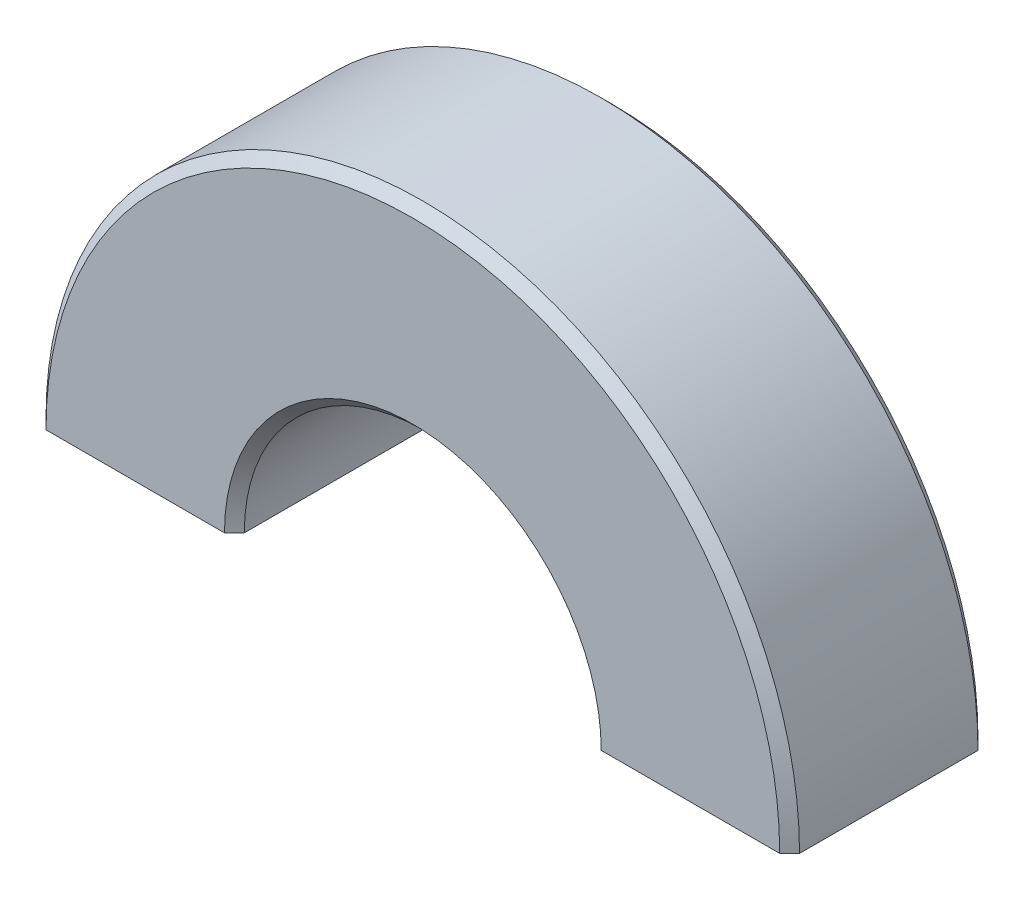
ISO-10303-21;
HEADER;
FILE_DESCRIPTION(('STEP AP214'),'2;1');
FILE_NAME('part.step','',(''),(''),'','','');
FILE_SCHEMA(('AUTOMOTIVE_DESIGN { 1 0 10303 214 1 1 1 1 }'));
ENDSEC;
DATA;
#1=APPLICATION_CONTEXT('core data for automotive mechanical design processes');
#2=APPLICATION_PROTOCOL_DEFINITION('international standard','automotive_design',2000,#1);
#3=PRODUCT_CONTEXT('',#1,'mechanical');
#4=PRODUCT('Part','Part','',(#3));
#5=PRODUCT_RELATED_PRODUCT_CATEGORY('part','',(#4));
#6=PRODUCT_DEFINITION_FORMATION('','',#4);
#7=PRODUCT_DEFINITION_CONTEXT('part definition',#1,'design');
#8=PRODUCT_DEFINITION('design','',#6,#7);
#9=PRODUCT_DEFINITION_SHAPE('','',#8);
#10=(LENGTH_UNIT() NAMED_UNIT(*) SI_UNIT(.MILLI.,.METRE.));
#11=(NAMED_UNIT(*) PLANE_ANGLE_UNIT() SI_UNIT($,.RADIAN.));
#12=(NAMED_UNIT(*) SI_UNIT($,.STERADIAN.) SOLID_ANGLE_UNIT());
#13=UNCERTAINTY_MEASURE_WITH_UNIT(LENGTH_MEASURE(1.E-05),#10,'distance_accuracy_value','');
#14=(GEOMETRIC_REPRESENTATION_CONTEXT(3) GLOBAL_UNCERTAINTY_ASSIGNED_CONTEXT((#13)) GLOBAL_UNIT_ASSIGNED_CONTEXT((#10,
#11,#12)) REPRESENTATION_CONTEXT('',''));
#15=CARTESIAN_POINT('',(0.,0.,0.));
#16=DIRECTION('',(0.,0.,1.));
#17=DIRECTION('',(1.,0.,0.));
#18=AXIS2_PLACEMENT_3D('',#15,#16,#17);
#19=CARTESIAN_POINT('',(0.,0.,10.));
#20=DIRECTION('',(0.,0.,-1.));
#21=DIRECTION('',(-1.,0.,0.));
#22=AXIS2_PLACEMENT_3D('',#19,#20,#21);
#23=CYLINDRICAL_SURFACE('',#22,9.);
#24=DIRECTION('',(0.,0.,-1.));
#25=VECTOR('',#24,1.);
#26=CARTESIAN_POINT('',(-9.,0.,10.));
#27=LINE('',#26,#25);
#28=CARTESIAN_POINT('',(-9.,0.,9.49999999999999));
#29=VERTEX_POINT('',#28);
#30=CARTESIAN_POINT('',(-9.,0.,0.500000000000011));
#31=VERTEX_POINT('',#30);
#32=EDGE_CURVE('E127',#29,#31,#27,.T.);
#33=ORIENTED_EDGE('',*,*,#32,.T.);
#34=CARTESIAN_POINT('',(0.,0.,0.500000000000011));
#35=DIRECTION('',(0.,0.,1.));
#36=DIRECTION('',(1.,0.,0.));
#37=AXIS2_PLACEMENT_3D('',#34,#35,#36);
#38=CIRCLE('',#37,9.);
#39=CARTESIAN_POINT('',(9.,0.,0.500000000000011));
#40=VERTEX_POINT('',#39);
#41=EDGE_CURVE('E153',#31,#40,#38,.F.);
#42=ORIENTED_EDGE('',*,*,#41,.T.);
#43=DIRECTION('',(0.,0.,-1.));
#44=VECTOR('',#43,1.);
#45=CARTESIAN_POINT('',(9.,0.,10.));
#46=LINE('',#45,#44);
#47=CARTESIAN_POINT('',(9.,0.,9.49999999999999));
#48=VERTEX_POINT('',#47);
#49=EDGE_CURVE('E131',#48,#40,#46,.T.);
#50=ORIENTED_EDGE('',*,*,#49,.F.);
#51=CARTESIAN_POINT('',(0.,0.,9.49999999999999));
#52=DIRECTION('',(0.,0.,1.));
#53=DIRECTION('',(1.,0.,0.));
#54=AXIS2_PLACEMENT_3D('',#51,#52,#53);
#55=CIRCLE('',#54,9.);
#56=EDGE_CURVE('E151',#48,#29,#55,.T.);
#57=ORIENTED_EDGE('',*,*,#56,.T.);
#58=EDGE_LOOP('',(#33,#42,#50,#57));
#59=FACE_BOUND('',#58,.T.);
#60=ADVANCED_FACE('F38',(#59),#23,.F.);
#61=CARTESIAN_POINT('',(9.,0.,10.));
#62=DIRECTION('',(0.,1.,0.));
#63=DIRECTION('',(-1.,0.,0.));
#64=AXIS2_PLACEMENT_3D('',#61,#62,#63);
#65=PLANE('',#64);
#66=DIRECTION('',(1.,0.,0.));
#67=VECTOR('',#66,1.);
#68=CARTESIAN_POINT('',(9.,0.,0.));
#69=LINE('',#68,#67);
#70=CARTESIAN_POINT('',(9.50000000000002,0.,0.));
#71=VERTEX_POINT('',#70);
#72=CARTESIAN_POINT('',(18.5,0.,0.));
#73=VERTEX_POINT('',#72);
#74=EDGE_CURVE('E163',#71,#73,#69,.T.);
#75=ORIENTED_EDGE('',*,*,#74,.T.);
#76=DIRECTION('',(-0.707106781186545,0.,-0.70710678118655));
#77=VECTOR('',#76,1.);
#78=CARTESIAN_POINT('',(0.,0.,-18.5000000000001));
#79=LINE('',#78,#77);
#80=CARTESIAN_POINT('',(19.,0.,0.500000000000011));
#81=VERTEX_POINT('',#80);
#82=EDGE_CURVE('E149',#73,#81,#79,.F.);
#83=ORIENTED_EDGE('',*,*,#82,.T.);
#84=DIRECTION('',(0.,0.,-1.));
#85=VECTOR('',#84,1.);
#86=CARTESIAN_POINT('',(19.,0.,10.));
#87=LINE('',#86,#85);
#88=CARTESIAN_POINT('',(19.,0.,9.50000000000001));
#89=VERTEX_POINT('',#88);
#90=EDGE_CURVE('E126',#89,#81,#87,.T.);
#91=ORIENTED_EDGE('',*,*,#90,.F.);
#92=DIRECTION('',(0.707106781186545,0.,-0.70710678118655));
#93=VECTOR('',#92,1.);
#94=CARTESIAN_POINT('',(0.,0.,28.5000000000001));
#95=LINE('',#94,#93);
#96=CARTESIAN_POINT('',(18.5,0.,10.));
#97=VERTEX_POINT('',#96);
#98=EDGE_CURVE('E130',#89,#97,#95,.F.);
#99=ORIENTED_EDGE('',*,*,#98,.T.);
#100=DIRECTION('',(1.,0.,0.));
#101=VECTOR('',#100,1.);
#102=CARTESIAN_POINT('',(9.,0.,10.));
#103=LINE('',#102,#101);
#104=CARTESIAN_POINT('',(9.50000000000001,0.,10.));
#105=VERTEX_POINT('',#104);
#106=EDGE_CURVE('E158',#105,#97,#103,.T.);
#107=ORIENTED_EDGE('',*,*,#106,.F.);
#108=DIRECTION('',(-0.707106781186547,0.,-0.707106781186548));
#109=VECTOR('',#108,1.);
#110=CARTESIAN_POINT('',(0.,0.,0.499999999999992));
#111=LINE('',#110,#109);
#112=EDGE_CURVE('E62',#105,#48,#111,.T.);
#113=ORIENTED_EDGE('',*,*,#112,.T.);
#114=ORIENTED_EDGE('',*,*,#49,.T.);
#115=DIRECTION('',(0.707106781186551,0.,-0.707106781186544));
#116=VECTOR('',#115,1.);
#117=CARTESIAN_POINT('',(0.,0.,9.49999999999992));
#118=LINE('',#117,#116);
#119=EDGE_CURVE('E54',#40,#71,#118,.T.);
#120=ORIENTED_EDGE('',*,*,#119,.T.);
#121=EDGE_LOOP('',(#75,#83,#91,#99,#107,#113,#114,#120));
#122=FACE_BOUND('',#121,.T.);
#123=ADVANCED_FACE('F193',(#122),#65,.F.);
#124=CARTESIAN_POINT('',(0.,0.,10.));
#125=DIRECTION('',(0.,0.,-1.));
#126=DIRECTION('',(-1.,0.,0.));
#127=AXIS2_PLACEMENT_3D('',#124,#125,#126);
#128=CYLINDRICAL_SURFACE('',#127,19.);
#129=ORIENTED_EDGE('',*,*,#90,.T.);
#130=CARTESIAN_POINT('',(0.,0.,0.500000000000011));
#131=DIRECTION('',(0.,0.,1.));
#132=DIRECTION('',(1.,0.,0.));
#133=AXIS2_PLACEMENT_3D('',#130,#131,#132);
#134=CIRCLE('',#133,19.);
#135=CARTESIAN_POINT('',(-19.,0.,0.500000000000011));
#136=VERTEX_POINT('',#135);
#137=EDGE_CURVE('E117',#81,#136,#134,.T.);
#138=ORIENTED_EDGE('',*,*,#137,.T.);
#139=DIRECTION('',(0.,0.,-1.));
#140=VECTOR('',#139,1.);
#141=CARTESIAN_POINT('',(-19.,0.,10.));
#142=LINE('',#141,#140);
#143=CARTESIAN_POINT('',(-19.,0.,9.50000000000001));
#144=VERTEX_POINT('',#143);
#145=EDGE_CURVE('E109',#144,#136,#142,.T.);
#146=ORIENTED_EDGE('',*,*,#145,.F.);
#147=CARTESIAN_POINT('',(0.,0.,9.50000000000001));
#148=DIRECTION('',(0.,0.,1.));
#149=DIRECTION('',(1.,0.,0.));
#150=AXIS2_PLACEMENT_3D('',#147,#148,#149);
#151=CIRCLE('',#150,19.);
#152=EDGE_CURVE('E123',#144,#89,#151,.F.);
#153=ORIENTED_EDGE('',*,*,#152,.T.);
#154=EDGE_LOOP('',(#129,#138,#146,#153));
#155=FACE_BOUND('',#154,.T.);
#156=ADVANCED_FACE('F122',(#155),#128,.T.);
#157=CARTESIAN_POINT('',(-9.,0.,10.));
#158=DIRECTION('',(0.,1.,0.));
#159=DIRECTION('',(-1.,0.,0.));
#160=AXIS2_PLACEMENT_3D('',#157,#158,#159);
#161=PLANE('',#160);
#162=ORIENTED_EDGE('',*,*,#145,.T.);
#163=DIRECTION('',(-0.707106781186545,0.,0.70710678118655));
#164=VECTOR('',#163,1.);
#165=CARTESIAN_POINT('',(0.,0.,-18.5000000000001));
#166=LINE('',#165,#164);
#167=CARTESIAN_POINT('',(-18.5,0.,0.));
#168=VERTEX_POINT('',#167);
#169=EDGE_CURVE('E140',#136,#168,#166,.F.);
#170=ORIENTED_EDGE('',*,*,#169,.T.);
#171=DIRECTION('',(1.,0.,0.));
#172=VECTOR('',#171,1.);
#173=CARTESIAN_POINT('',(-9.,0.,0.));
#174=LINE('',#173,#172);
#175=CARTESIAN_POINT('',(-9.50000000000002,0.,0.));
#176=VERTEX_POINT('',#175);
#177=EDGE_CURVE('E159',#168,#176,#174,.T.);
#178=ORIENTED_EDGE('',*,*,#177,.T.);
#179=DIRECTION('',(0.707106781186551,0.,0.707106781186544));
#180=VECTOR('',#179,1.);
#181=CARTESIAN_POINT('',(0.,0.,9.49999999999992));
#182=LINE('',#181,#180);
#183=EDGE_CURVE('E138',#176,#31,#182,.T.);
#184=ORIENTED_EDGE('',*,*,#183,.T.);
#185=ORIENTED_EDGE('',*,*,#32,.F.);
#186=DIRECTION('',(-0.707106781186547,0.,0.707106781186548));
#187=VECTOR('',#186,1.);
#188=CARTESIAN_POINT('',(0.,0.,0.499999999999992));
#189=LINE('',#188,#187);
#190=CARTESIAN_POINT('',(-9.50000000000001,0.,10.));
#191=VERTEX_POINT('',#190);
#192=EDGE_CURVE('E116',#29,#191,#189,.T.);
#193=ORIENTED_EDGE('',*,*,#192,.T.);
#194=DIRECTION('',(1.,0.,0.));
#195=VECTOR('',#194,1.);
#196=CARTESIAN_POINT('',(-9.,0.,10.));
#197=LINE('',#196,#195);
#198=CARTESIAN_POINT('',(-18.5,0.,10.));
#199=VERTEX_POINT('',#198);
#200=EDGE_CURVE('E111',#199,#191,#197,.T.);
#201=ORIENTED_EDGE('',*,*,#200,.F.);
#202=DIRECTION('',(0.707106781186545,0.,0.70710678118655));
#203=VECTOR('',#202,1.);
#204=CARTESIAN_POINT('',(0.,0.,28.5000000000001));
#205=LINE('',#204,#203);
#206=EDGE_CURVE('E106',#199,#144,#205,.F.);
#207=ORIENTED_EDGE('',*,*,#206,.T.);
#208=EDGE_LOOP('',(#162,#170,#178,#184,#185,#193,#201,#207));
#209=FACE_BOUND('',#208,.T.);
#210=ADVANCED_FACE('F108',(#209),#161,.F.);
#211=CARTESIAN_POINT('',(0.,0.,10.));
#212=DIRECTION('',(0.,0.,1.));
#213=DIRECTION('',(1.,0.,0.));
#214=AXIS2_PLACEMENT_3D('',#211,#212,#213);
#215=PLANE('',#214);
#216=ORIENTED_EDGE('',*,*,#200,.T.);
#217=CARTESIAN_POINT('',(0.,0.,10.));
#218=DIRECTION('',(0.,0.,1.));
#219=DIRECTION('',(1.,0.,0.));
#220=AXIS2_PLACEMENT_3D('',#217,#218,#219);
#221=CIRCLE('',#220,9.50000000000001);
#222=EDGE_CURVE('E11',#191,#105,#221,.F.);
#223=ORIENTED_EDGE('',*,*,#222,.T.);
#224=ORIENTED_EDGE('',*,*,#106,.T.);
#225=CARTESIAN_POINT('',(0.,0.,10.));
#226=DIRECTION('',(0.,0.,1.));
#227=DIRECTION('',(1.,0.,0.));
#228=AXIS2_PLACEMENT_3D('',#225,#226,#227);
#229=CIRCLE('',#228,18.5);
#230=EDGE_CURVE('E47',#97,#199,#229,.T.);
#231=ORIENTED_EDGE('',*,*,#230,.T.);
#232=EDGE_LOOP('',(#216,#223,#224,#231));
#233=FACE_BOUND('',#232,.T.);
#234=ADVANCED_FACE('F156',(#233),#215,.T.);
#235=CARTESIAN_POINT('',(0.,0.,0.));
#236=DIRECTION('',(0.,0.,1.));
#237=DIRECTION('',(1.,0.,0.));
#238=AXIS2_PLACEMENT_3D('',#235,#236,#237);
#239=PLANE('',#238);
#240=ORIENTED_EDGE('',*,*,#177,.F.);
#241=CARTESIAN_POINT('',(0.,0.,0.));
#242=DIRECTION('',(0.,0.,1.));
#243=DIRECTION('',(1.,0.,0.));
#244=AXIS2_PLACEMENT_3D('',#241,#242,#243);
#245=CIRCLE('',#244,18.5);
#246=EDGE_CURVE('E144',#168,#73,#245,.F.);
#247=ORIENTED_EDGE('',*,*,#246,.T.);
#248=ORIENTED_EDGE('',*,*,#74,.F.);
#249=CARTESIAN_POINT('',(0.,0.,0.));
#250=DIRECTION('',(0.,0.,1.));
#251=DIRECTION('',(1.,0.,0.));
#252=AXIS2_PLACEMENT_3D('',#249,#250,#251);
#253=CIRCLE('',#252,9.50000000000002);
#254=EDGE_CURVE('E142',#71,#176,#253,.T.);
#255=ORIENTED_EDGE('',*,*,#254,.T.);
#256=EDGE_LOOP('',(#240,#247,#248,#255));
#257=FACE_BOUND('',#256,.T.);
#258=ADVANCED_FACE('F176',(#257),#239,.F.);
#259=CARTESIAN_POINT('',(0.,0.,0.500000000000011));
#260=DIRECTION('',(0.,0.,1.));
#261=DIRECTION('',(1.,0.,0.));
#262=AXIS2_PLACEMENT_3D('',#259,#260,#261);
#263=CONICAL_SURFACE('',#262,19.,0.785398163397445);
#264=ORIENTED_EDGE('',*,*,#82,.F.);
#265=ORIENTED_EDGE('',*,*,#246,.F.);
#266=ORIENTED_EDGE('',*,*,#169,.F.);
#267=ORIENTED_EDGE('',*,*,#137,.F.);
#268=EDGE_LOOP('',(#264,#265,#266,#267));
#269=FACE_BOUND('',#268,.T.);
#270=ADVANCED_FACE('F171',(#269),#263,.T.);
#271=CARTESIAN_POINT('',(0.,0.,0.500000000000011));
#272=DIRECTION('',(0.,0.,-1.));
#273=DIRECTION('',(-1.,0.,0.));
#274=AXIS2_PLACEMENT_3D('',#271,#272,#273);
#275=CONICAL_SURFACE('',#274,9.,0.785398163397453);
#276=ORIENTED_EDGE('',*,*,#183,.F.);
#277=ORIENTED_EDGE('',*,*,#254,.F.);
#278=ORIENTED_EDGE('',*,*,#119,.F.);
#279=ORIENTED_EDGE('',*,*,#41,.F.);
#280=EDGE_LOOP('',(#276,#277,#278,#279));
#281=FACE_BOUND('',#280,.T.);
#282=ADVANCED_FACE('F178',(#281),#275,.F.);
#283=CARTESIAN_POINT('',(0.,0.,10.));
#284=DIRECTION('',(0.,0.,1.));
#285=DIRECTION('',(1.,0.,0.));
#286=AXIS2_PLACEMENT_3D('',#283,#284,#285);
#287=CONICAL_SURFACE('',#286,9.50000000000001,0.785398163397448);
#288=ORIENTED_EDGE('',*,*,#192,.F.);
#289=ORIENTED_EDGE('',*,*,#56,.F.);
#290=ORIENTED_EDGE('',*,*,#112,.F.);
#291=ORIENTED_EDGE('',*,*,#222,.F.);
#292=EDGE_LOOP('',(#288,#289,#290,#291));
#293=FACE_BOUND('',#292,.T.);
#294=ADVANCED_FACE('F184',(#293),#287,.F.);
#295=CARTESIAN_POINT('',(0.,0.,10.));
#296=DIRECTION('',(0.,0.,-1.));
#297=DIRECTION('',(-1.,0.,0.));
#298=AXIS2_PLACEMENT_3D('',#295,#296,#297);
#299=CONICAL_SURFACE('',#298,18.5,0.785398163397445);
#300=ORIENTED_EDGE('',*,*,#98,.F.);
#301=ORIENTED_EDGE('',*,*,#152,.F.);
#302=ORIENTED_EDGE('',*,*,#206,.F.);
#303=ORIENTED_EDGE('',*,*,#230,.F.);
#304=EDGE_LOOP('',(#300,#301,#302,#303));
#305=FACE_BOUND('',#304,.T.);
#306=ADVANCED_FACE('F41',(#305),#299,.T.);
#307=CLOSED_SHELL('',(#60,#123,#156,#210,#234,#258,#270,#282,#294,#306));
#308=MANIFOLD_SOLID_BREP('B2',#307);
#309=ADVANCED_BREP_SHAPE_REPRESENTATION('',(#18,#308),#14);
#310=SHAPE_DEFINITION_REPRESENTATION(#9,#309);
ENDSEC;
END-ISO-10303-21;
